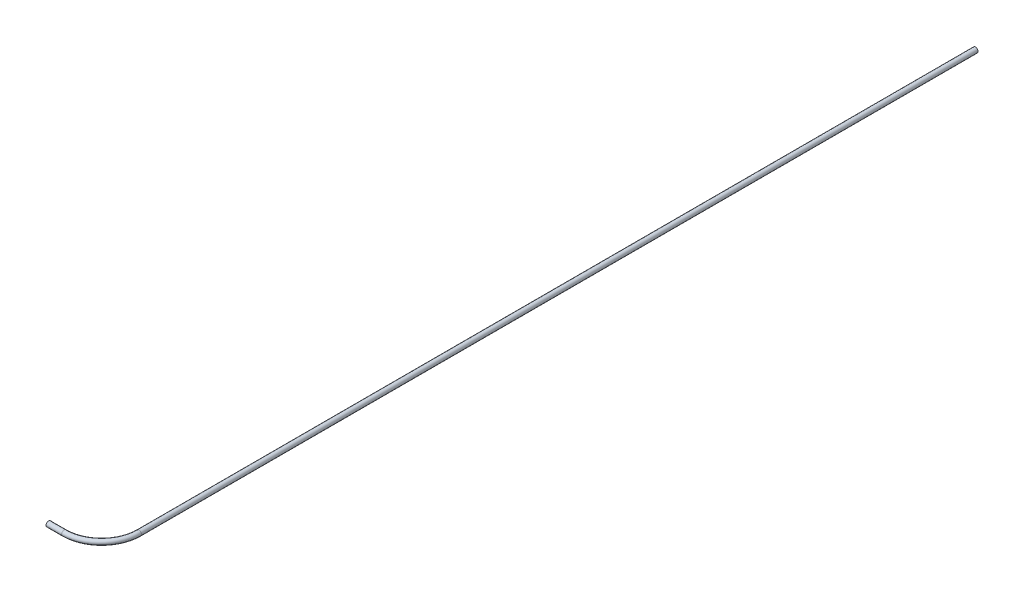
ISO-10303-21;
HEADER;
FILE_DESCRIPTION(('STEP AP214'),'2;1');
FILE_NAME('part.step','',(''),(''),'','','');
FILE_SCHEMA(('AUTOMOTIVE_DESIGN { 1 0 10303 214 1 1 1 1 }'));
ENDSEC;
DATA;
#1=APPLICATION_CONTEXT('core data for automotive mechanical design processes');
#2=APPLICATION_PROTOCOL_DEFINITION('international standard','automotive_design',2000,#1);
#3=PRODUCT_CONTEXT('',#1,'mechanical');
#4=PRODUCT('Part','Part','',(#3));
#5=PRODUCT_RELATED_PRODUCT_CATEGORY('part','',(#4));
#6=PRODUCT_DEFINITION_FORMATION('','',#4);
#7=PRODUCT_DEFINITION_CONTEXT('part definition',#1,'design');
#8=PRODUCT_DEFINITION('design','',#6,#7);
#9=PRODUCT_DEFINITION_SHAPE('','',#8);
#10=(LENGTH_UNIT() NAMED_UNIT(*) SI_UNIT(.MILLI.,.METRE.));
#11=(NAMED_UNIT(*) PLANE_ANGLE_UNIT() SI_UNIT($,.RADIAN.));
#12=(NAMED_UNIT(*) SI_UNIT($,.STERADIAN.) SOLID_ANGLE_UNIT());
#13=UNCERTAINTY_MEASURE_WITH_UNIT(LENGTH_MEASURE(1.E-05),#10,'distance_accuracy_value','');
#14=(GEOMETRIC_REPRESENTATION_CONTEXT(3) GLOBAL_UNCERTAINTY_ASSIGNED_CONTEXT((#13)) GLOBAL_UNIT_ASSIGNED_CONTEXT((#10,
#11,#12)) REPRESENTATION_CONTEXT('',''));
#15=CARTESIAN_POINT('',(0.,0.,0.));
#16=DIRECTION('',(0.,0.,1.));
#17=DIRECTION('',(1.,0.,0.));
#18=AXIS2_PLACEMENT_3D('',#15,#16,#17);
#19=CARTESIAN_POINT('',(49.521745,0.,-34.925));
#20=DIRECTION('',(0.,0.,-1.));
#21=DIRECTION('',(-1.,0.,0.));
#22=AXIS2_PLACEMENT_3D('',#19,#20,#21);
#23=CYLINDRICAL_SURFACE('',#22,2.38125);
#24=CARTESIAN_POINT('',(49.521745,0.,-34.925));
#25=DIRECTION('',(0.,0.,-1.));
#26=DIRECTION('',(-1.,0.,0.));
#27=AXIS2_PLACEMENT_3D('',#24,#25,#26);
#28=CIRCLE('',#27,2.38125);
#29=CARTESIAN_POINT('',(51.902995,0.,-34.925));
#30=VERTEX_POINT('',#29);
#31=EDGE_CURVE('E42',#30,#30,#28,.T.);
#32=ORIENTED_EDGE('',*,*,#31,.T.);
#33=EDGE_LOOP('',(#32));
#34=FACE_BOUND('',#33,.T.);
#35=CARTESIAN_POINT('',(49.521745,0.,-815.975));
#36=DIRECTION('',(0.,0.,-1.));
#37=DIRECTION('',(-1.,0.,0.));
#38=AXIS2_PLACEMENT_3D('',#35,#36,#37);
#39=CIRCLE('',#38,2.38125);
#40=CARTESIAN_POINT('',(47.140495,0.,-815.975));
#41=VERTEX_POINT('',#40);
#42=EDGE_CURVE('E10',#41,#41,#39,.T.);
#43=ORIENTED_EDGE('',*,*,#42,.F.);
#44=EDGE_LOOP('',(#43));
#45=FACE_BOUND('',#44,.T.);
#46=ADVANCED_FACE('F32',(#34,#45),#23,.T.);
#47=CARTESIAN_POINT('',(49.521745,0.,-34.925));
#48=DIRECTION('',(0.,0.,-1.));
#49=DIRECTION('',(-1.,0.,0.));
#50=AXIS2_PLACEMENT_3D('',#47,#48,#49);
#51=CYLINDRICAL_SURFACE('',#50,1.82245);
#52=CARTESIAN_POINT('',(49.521745,0.,-34.925));
#53=DIRECTION('',(0.,0.,-1.));
#54=DIRECTION('',(-1.,0.,0.));
#55=AXIS2_PLACEMENT_3D('',#52,#53,#54);
#56=CIRCLE('',#55,1.82245);
#57=CARTESIAN_POINT('',(51.344195,0.,-34.925));
#58=VERTEX_POINT('',#57);
#59=EDGE_CURVE('E46',#58,#58,#56,.T.);
#60=ORIENTED_EDGE('',*,*,#59,.F.);
#61=EDGE_LOOP('',(#60));
#62=FACE_BOUND('',#61,.T.);
#63=CARTESIAN_POINT('',(49.521745,0.,-815.975));
#64=DIRECTION('',(0.,0.,-1.));
#65=DIRECTION('',(-1.,0.,0.));
#66=AXIS2_PLACEMENT_3D('',#63,#64,#65);
#67=CIRCLE('',#66,1.82245);
#68=CARTESIAN_POINT('',(47.699295,0.,-815.975));
#69=VERTEX_POINT('',#68);
#70=EDGE_CURVE('E38',#69,#69,#67,.T.);
#71=ORIENTED_EDGE('',*,*,#70,.T.);
#72=EDGE_LOOP('',(#71));
#73=FACE_BOUND('',#72,.T.);
#74=ADVANCED_FACE('F74',(#62,#73),#51,.F.);
#75=CARTESIAN_POINT('',(14.596745,0.,-34.925));
#76=DIRECTION('',(0.,1.,0.));
#77=DIRECTION('',(0.,0.,1.));
#78=AXIS2_PLACEMENT_3D('',#75,#76,#77);
#79=TOROIDAL_SURFACE('',#78,34.925,2.38125);
#80=CARTESIAN_POINT('',(14.596745,0.,0.));
#81=DIRECTION('',(1.,0.,0.));
#82=DIRECTION('',(0.,0.,-1.));
#83=AXIS2_PLACEMENT_3D('',#80,#81,#82);
#84=CIRCLE('',#83,2.38125);
#85=CARTESIAN_POINT('',(14.596745,0.,2.38125));
#86=VERTEX_POINT('',#85);
#87=EDGE_CURVE('E51',#86,#86,#84,.T.);
#88=CARTESIAN_POINT('',(14.596745,0.,-34.925));
#89=DIRECTION('',(0.,1.,0.));
#90=DIRECTION('',(0.,0.,1.));
#91=AXIS2_PLACEMENT_3D('',#88,#89,#90);
#92=CIRCLE('',#91,37.30625);
#93=EDGE_CURVE('',#86,#30,#92,.T.);
#94=ORIENTED_EDGE('',*,*,#87,.T.);
#95=ORIENTED_EDGE('',*,*,#31,.F.);
#96=ORIENTED_EDGE('',*,*,#93,.T.);
#97=ORIENTED_EDGE('',*,*,#93,.F.);
#98=EDGE_LOOP('',(#94,#96,#95,#97));
#99=FACE_BOUND('',#98,.T.);
#100=ADVANCED_FACE('F70',(#99),#79,.T.);
#101=CARTESIAN_POINT('',(14.596745,0.,-34.925));
#102=DIRECTION('',(0.,1.,0.));
#103=DIRECTION('',(0.,0.,1.));
#104=AXIS2_PLACEMENT_3D('',#101,#102,#103);
#105=TOROIDAL_SURFACE('',#104,34.925,1.82245);
#106=CARTESIAN_POINT('',(14.596745,0.,0.));
#107=DIRECTION('',(1.,0.,0.));
#108=DIRECTION('',(0.,0.,-1.));
#109=AXIS2_PLACEMENT_3D('',#106,#107,#108);
#110=CIRCLE('',#109,1.82245);
#111=CARTESIAN_POINT('',(14.596745,0.,1.82245));
#112=VERTEX_POINT('',#111);
#113=EDGE_CURVE('E55',#112,#112,#110,.T.);
#114=CARTESIAN_POINT('',(14.596745,0.,-34.925));
#115=DIRECTION('',(0.,1.,0.));
#116=DIRECTION('',(0.,0.,1.));
#117=AXIS2_PLACEMENT_3D('',#114,#115,#116);
#118=CIRCLE('',#117,36.74745);
#119=EDGE_CURVE('',#112,#58,#118,.T.);
#120=ORIENTED_EDGE('',*,*,#113,.F.);
#121=ORIENTED_EDGE('',*,*,#59,.T.);
#122=ORIENTED_EDGE('',*,*,#119,.T.);
#123=ORIENTED_EDGE('',*,*,#119,.F.);
#124=EDGE_LOOP('',(#120,#122,#121,#123));
#125=FACE_BOUND('',#124,.T.);
#126=ADVANCED_FACE('F67',(#125),#105,.F.);
#127=CARTESIAN_POINT('',(14.596745,0.,0.));
#128=DIRECTION('',(-1.,0.,0.));
#129=DIRECTION('',(0.,0.,1.));
#130=AXIS2_PLACEMENT_3D('',#127,#128,#129);
#131=CYLINDRICAL_SURFACE('',#130,1.82245);
#132=ORIENTED_EDGE('',*,*,#113,.T.);
#133=EDGE_LOOP('',(#132));
#134=FACE_BOUND('',#133,.T.);
#135=CARTESIAN_POINT('',(0.,0.,0.));
#136=DIRECTION('',(1.,0.,0.));
#137=DIRECTION('',(0.,0.,-1.));
#138=AXIS2_PLACEMENT_3D('',#135,#136,#137);
#139=CIRCLE('',#138,1.82245);
#140=CARTESIAN_POINT('',(0.,0.,-1.82245));
#141=VERTEX_POINT('',#140);
#142=EDGE_CURVE('E56',#141,#141,#139,.T.);
#143=ORIENTED_EDGE('',*,*,#142,.F.);
#144=EDGE_LOOP('',(#143));
#145=FACE_BOUND('',#144,.T.);
#146=ADVANCED_FACE('F64',(#134,#145),#131,.F.);
#147=CARTESIAN_POINT('',(14.596745,0.,0.));
#148=DIRECTION('',(-1.,0.,0.));
#149=DIRECTION('',(0.,0.,1.));
#150=AXIS2_PLACEMENT_3D('',#147,#148,#149);
#151=CYLINDRICAL_SURFACE('',#150,2.38125);
#152=ORIENTED_EDGE('',*,*,#87,.F.);
#153=EDGE_LOOP('',(#152));
#154=FACE_BOUND('',#153,.T.);
#155=CARTESIAN_POINT('',(0.,0.,0.));
#156=DIRECTION('',(1.,0.,0.));
#157=DIRECTION('',(0.,0.,-1.));
#158=AXIS2_PLACEMENT_3D('',#155,#156,#157);
#159=CIRCLE('',#158,2.38125);
#160=CARTESIAN_POINT('',(0.,0.,-2.38125));
#161=VERTEX_POINT('',#160);
#162=EDGE_CURVE('E52',#161,#161,#159,.T.);
#163=ORIENTED_EDGE('',*,*,#162,.T.);
#164=EDGE_LOOP('',(#163));
#165=FACE_BOUND('',#164,.T.);
#166=ADVANCED_FACE('F86',(#154,#165),#151,.T.);
#167=CARTESIAN_POINT('',(49.521745,0.,-815.975));
#168=DIRECTION('',(0.,0.,-1.));
#169=DIRECTION('',(-1.,0.,0.));
#170=AXIS2_PLACEMENT_3D('',#167,#168,#169);
#171=PLANE('',#170);
#172=ORIENTED_EDGE('',*,*,#70,.F.);
#173=EDGE_LOOP('',(#172));
#174=FACE_BOUND('',#173,.T.);
#175=ORIENTED_EDGE('',*,*,#42,.T.);
#176=EDGE_LOOP('',(#175));
#177=FACE_BOUND('',#176,.T.);
#178=ADVANCED_FACE('F89',(#174,#177),#171,.T.);
#179=CARTESIAN_POINT('',(0.,0.,0.));
#180=DIRECTION('',(1.,0.,0.));
#181=DIRECTION('',(0.,0.,-1.));
#182=AXIS2_PLACEMENT_3D('',#179,#180,#181);
#183=PLANE('',#182);
#184=ORIENTED_EDGE('',*,*,#142,.T.);
#185=EDGE_LOOP('',(#184));
#186=FACE_BOUND('',#185,.T.);
#187=ORIENTED_EDGE('',*,*,#162,.F.);
#188=EDGE_LOOP('',(#187));
#189=FACE_BOUND('',#188,.T.);
#190=ADVANCED_FACE('F91',(#186,#189),#183,.F.);
#191=CLOSED_SHELL('',(#46,#74,#100,#126,#146,#166,#178,#190));
#192=MANIFOLD_SOLID_BREP('B2',#191);
#193=ADVANCED_BREP_SHAPE_REPRESENTATION('',(#18,#192),#14);
#194=SHAPE_DEFINITION_REPRESENTATION(#9,#193);
ENDSEC;
END-ISO-10303-21;
